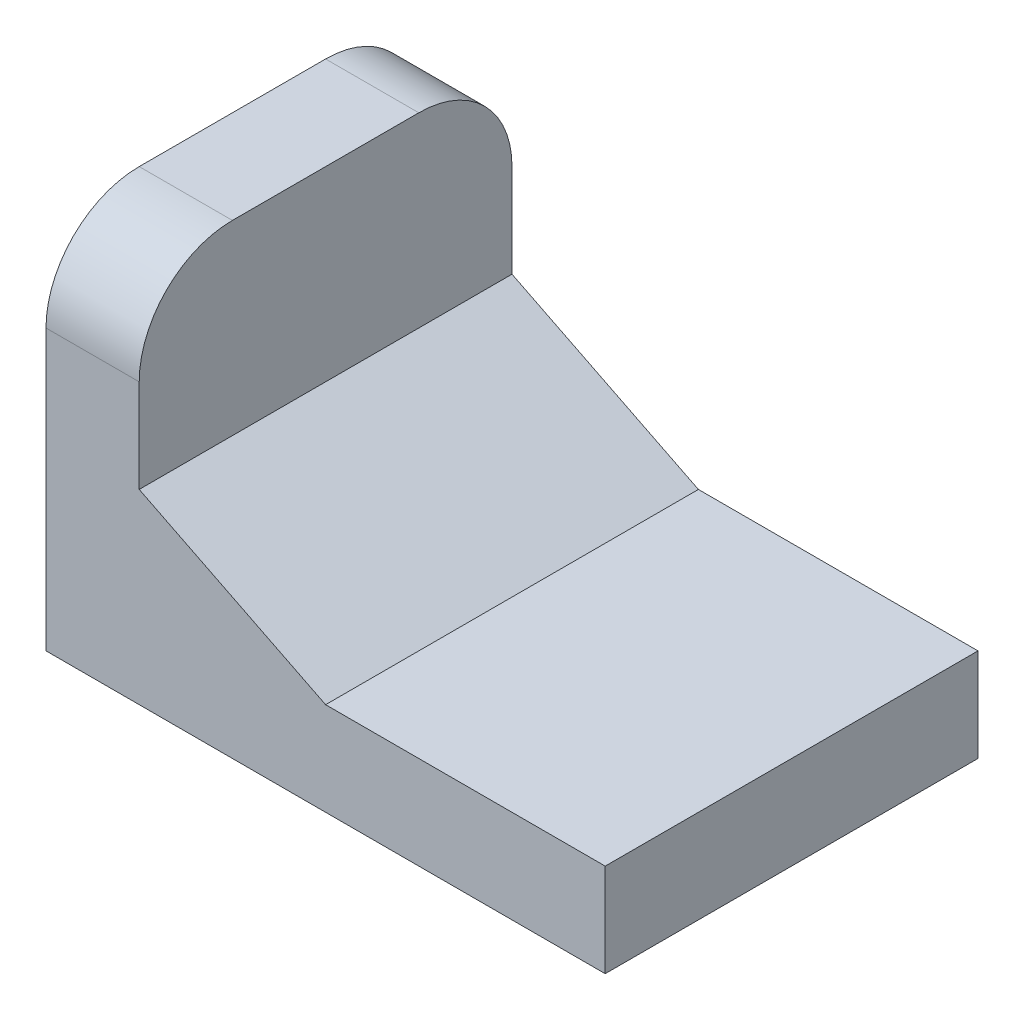
ISO-10303-21;
HEADER;
FILE_DESCRIPTION(('STEP AP214'),'2;1');
FILE_NAME('part.step','',(''),(''),'','','');
FILE_SCHEMA(('AUTOMOTIVE_DESIGN { 1 0 10303 214 1 1 1 1 }'));
ENDSEC;
DATA;
#1=APPLICATION_CONTEXT('core data for automotive mechanical design processes');
#2=APPLICATION_PROTOCOL_DEFINITION('international standard','automotive_design',2000,#1);
#3=PRODUCT_CONTEXT('',#1,'mechanical');
#4=PRODUCT('Part','Part','',(#3));
#5=PRODUCT_RELATED_PRODUCT_CATEGORY('part','',(#4));
#6=PRODUCT_DEFINITION_FORMATION('','',#4);
#7=PRODUCT_DEFINITION_CONTEXT('part definition',#1,'design');
#8=PRODUCT_DEFINITION('design','',#6,#7);
#9=PRODUCT_DEFINITION_SHAPE('','',#8);
#10=(LENGTH_UNIT() NAMED_UNIT(*) SI_UNIT(.MILLI.,.METRE.));
#11=(NAMED_UNIT(*) PLANE_ANGLE_UNIT() SI_UNIT($,.RADIAN.));
#12=(NAMED_UNIT(*) SI_UNIT($,.STERADIAN.) SOLID_ANGLE_UNIT());
#13=UNCERTAINTY_MEASURE_WITH_UNIT(LENGTH_MEASURE(1.E-05),#10,'distance_accuracy_value','');
#14=(GEOMETRIC_REPRESENTATION_CONTEXT(3) GLOBAL_UNCERTAINTY_ASSIGNED_CONTEXT((#13)) GLOBAL_UNIT_ASSIGNED_CONTEXT((#10,
#11,#12)) REPRESENTATION_CONTEXT('',''));
#15=CARTESIAN_POINT('',(0.,0.,0.));
#16=DIRECTION('',(0.,0.,1.));
#17=DIRECTION('',(1.,0.,0.));
#18=AXIS2_PLACEMENT_3D('',#15,#16,#17);
#19=CARTESIAN_POINT('',(0.,0.,20.));
#20=DIRECTION('',(0.,1.,0.));
#21=DIRECTION('',(0.,0.,1.));
#22=AXIS2_PLACEMENT_3D('',#19,#20,#21);
#23=PLANE('',#22);
#24=DIRECTION('',(1.,0.,0.));
#25=VECTOR('',#24,1.);
#26=CARTESIAN_POINT('',(0.,0.,0.));
#27=LINE('',#26,#25);
#28=CARTESIAN_POINT('',(0.,0.,0.));
#29=VERTEX_POINT('',#28);
#30=CARTESIAN_POINT('',(30.,0.,0.));
#31=VERTEX_POINT('',#30);
#32=EDGE_CURVE('E132',#29,#31,#27,.T.);
#33=ORIENTED_EDGE('',*,*,#32,.T.);
#34=DIRECTION('',(0.,0.,-1.));
#35=VECTOR('',#34,1.);
#36=CARTESIAN_POINT('',(30.,0.,20.));
#37=LINE('',#36,#35);
#38=CARTESIAN_POINT('',(30.,0.,20.));
#39=VERTEX_POINT('',#38);
#40=EDGE_CURVE('E117',#39,#31,#37,.T.);
#41=ORIENTED_EDGE('',*,*,#40,.F.);
#42=DIRECTION('',(1.,0.,0.));
#43=VECTOR('',#42,1.);
#44=CARTESIAN_POINT('',(0.,0.,20.));
#45=LINE('',#44,#43);
#46=CARTESIAN_POINT('',(0.,0.,20.));
#47=VERTEX_POINT('',#46);
#48=EDGE_CURVE('E123',#47,#39,#45,.T.);
#49=ORIENTED_EDGE('',*,*,#48,.F.);
#50=DIRECTION('',(0.,0.,-1.));
#51=VECTOR('',#50,1.);
#52=CARTESIAN_POINT('',(0.,0.,20.));
#53=LINE('',#52,#51);
#54=EDGE_CURVE('E175',#47,#29,#53,.T.);
#55=ORIENTED_EDGE('',*,*,#54,.T.);
#56=EDGE_LOOP('',(#33,#41,#49,#55));
#57=FACE_BOUND('',#56,.T.);
#58=ADVANCED_FACE('F39',(#57),#23,.F.);
#59=CARTESIAN_POINT('',(30.,0.,20.));
#60=DIRECTION('',(-1.,0.,0.));
#61=DIRECTION('',(0.,0.,1.));
#62=AXIS2_PLACEMENT_3D('',#59,#60,#61);
#63=PLANE('',#62);
#64=DIRECTION('',(0.,1.,0.));
#65=VECTOR('',#64,1.);
#66=CARTESIAN_POINT('',(30.,0.,0.));
#67=LINE('',#66,#65);
#68=CARTESIAN_POINT('',(30.,5.,0.));
#69=VERTEX_POINT('',#68);
#70=EDGE_CURVE('E191',#31,#69,#67,.T.);
#71=ORIENTED_EDGE('',*,*,#70,.T.);
#72=DIRECTION('',(0.,0.,-1.));
#73=VECTOR('',#72,1.);
#74=CARTESIAN_POINT('',(30.,5.,20.));
#75=LINE('',#74,#73);
#76=CARTESIAN_POINT('',(30.,5.,20.));
#77=VERTEX_POINT('',#76);
#78=EDGE_CURVE('E119',#77,#69,#75,.T.);
#79=ORIENTED_EDGE('',*,*,#78,.F.);
#80=DIRECTION('',(0.,1.,0.));
#81=VECTOR('',#80,1.);
#82=CARTESIAN_POINT('',(30.,0.,20.));
#83=LINE('',#82,#81);
#84=EDGE_CURVE('E112',#39,#77,#83,.T.);
#85=ORIENTED_EDGE('',*,*,#84,.F.);
#86=ORIENTED_EDGE('',*,*,#40,.T.);
#87=EDGE_LOOP('',(#71,#79,#85,#86));
#88=FACE_BOUND('',#87,.T.);
#89=ADVANCED_FACE('F115',(#88),#63,.F.);
#90=CARTESIAN_POINT('',(0.,5.,20.));
#91=DIRECTION('',(0.,1.,0.));
#92=DIRECTION('',(0.,0.,1.));
#93=AXIS2_PLACEMENT_3D('',#90,#91,#92);
#94=PLANE('',#93);
#95=DIRECTION('',(1.,0.,0.));
#96=VECTOR('',#95,1.);
#97=CARTESIAN_POINT('',(0.,5.,0.));
#98=LINE('',#97,#96);
#99=CARTESIAN_POINT('',(15.,5.,0.));
#100=VERTEX_POINT('',#99);
#101=EDGE_CURVE('E188',#100,#69,#98,.T.);
#102=ORIENTED_EDGE('',*,*,#101,.F.);
#103=DIRECTION('',(0.,0.,-1.));
#104=VECTOR('',#103,1.);
#105=CARTESIAN_POINT('',(15.,5.,20.));
#106=LINE('',#105,#104);
#107=CARTESIAN_POINT('',(15.,5.,20.));
#108=VERTEX_POINT('',#107);
#109=EDGE_CURVE('E138',#108,#100,#106,.T.);
#110=ORIENTED_EDGE('',*,*,#109,.F.);
#111=DIRECTION('',(1.,0.,0.));
#112=VECTOR('',#111,1.);
#113=CARTESIAN_POINT('',(0.,5.,20.));
#114=LINE('',#113,#112);
#115=EDGE_CURVE('E122',#108,#77,#114,.T.);
#116=ORIENTED_EDGE('',*,*,#115,.T.);
#117=ORIENTED_EDGE('',*,*,#78,.T.);
#118=EDGE_LOOP('',(#102,#110,#116,#117));
#119=FACE_BOUND('',#118,.T.);
#120=ADVANCED_FACE('F190',(#119),#94,.T.);
#121=CARTESIAN_POINT('',(4.99999999999999,10.,20.));
#122=DIRECTION('',(-0.447213595499958,-0.894427190999916,0.));
#123=DIRECTION('',(0.894427190999916,-0.447213595499958,0.));
#124=AXIS2_PLACEMENT_3D('',#121,#122,#123);
#125=PLANE('',#124);
#126=DIRECTION('',(-0.894427190999916,0.447213595499958,0.));
#127=VECTOR('',#126,1.);
#128=CARTESIAN_POINT('',(4.99999999999999,10.,0.));
#129=LINE('',#128,#127);
#130=CARTESIAN_POINT('',(5.,9.99999999999999,0.));
#131=VERTEX_POINT('',#130);
#132=EDGE_CURVE('E183',#100,#131,#129,.T.);
#133=ORIENTED_EDGE('',*,*,#132,.T.);
#134=DIRECTION('',(0.,0.,-1.));
#135=VECTOR('',#134,1.);
#136=CARTESIAN_POINT('',(5.,9.99999999999999,20.));
#137=LINE('',#136,#135);
#138=CARTESIAN_POINT('',(5.,9.99999999999999,20.));
#139=VERTEX_POINT('',#138);
#140=EDGE_CURVE('E172',#139,#131,#137,.T.);
#141=ORIENTED_EDGE('',*,*,#140,.F.);
#142=DIRECTION('',(-0.894427190999916,0.447213595499958,0.));
#143=VECTOR('',#142,1.);
#144=CARTESIAN_POINT('',(4.99999999999999,10.,20.));
#145=LINE('',#144,#143);
#146=EDGE_CURVE('E184',#108,#139,#145,.T.);
#147=ORIENTED_EDGE('',*,*,#146,.F.);
#148=ORIENTED_EDGE('',*,*,#109,.T.);
#149=EDGE_LOOP('',(#133,#141,#147,#148));
#150=FACE_BOUND('',#149,.T.);
#151=ADVANCED_FACE('F181',(#150),#125,.F.);
#152=CARTESIAN_POINT('',(5.00000000000001,0.,20.));
#153=DIRECTION('',(-1.,0.,0.));
#154=DIRECTION('',(0.,-1.,0.));
#155=AXIS2_PLACEMENT_3D('',#152,#153,#154);
#156=PLANE('',#155);
#157=DIRECTION('',(0.,1.,0.));
#158=VECTOR('',#157,1.);
#159=CARTESIAN_POINT('',(5.00000000000001,0.,0.));
#160=LINE('',#159,#158);
#161=CARTESIAN_POINT('',(5.,15.,0.));
#162=VERTEX_POINT('',#161);
#163=EDGE_CURVE('E162',#131,#162,#160,.T.);
#164=ORIENTED_EDGE('',*,*,#163,.T.);
#165=CARTESIAN_POINT('',(5.,15.,5.));
#166=DIRECTION('',(-1.,0.,0.));
#167=DIRECTION('',(0.,-1.,0.));
#168=AXIS2_PLACEMENT_3D('',#165,#166,#167);
#169=CIRCLE('',#168,5.);
#170=CARTESIAN_POINT('',(4.99999999999999,20.,5.));
#171=VERTEX_POINT('',#170);
#172=EDGE_CURVE('E143',#162,#171,#169,.F.);
#173=ORIENTED_EDGE('',*,*,#172,.T.);
#174=DIRECTION('',(0.,0.,-1.));
#175=VECTOR('',#174,1.);
#176=CARTESIAN_POINT('',(4.99999999999999,20.,20.));
#177=LINE('',#176,#175);
#178=CARTESIAN_POINT('',(4.99999999999999,20.,15.));
#179=VERTEX_POINT('',#178);
#180=EDGE_CURVE('E168',#179,#171,#177,.T.);
#181=ORIENTED_EDGE('',*,*,#180,.F.);
#182=CARTESIAN_POINT('',(5.,15.,15.));
#183=DIRECTION('',(-1.,0.,0.));
#184=DIRECTION('',(0.,-1.,0.));
#185=AXIS2_PLACEMENT_3D('',#182,#183,#184);
#186=CIRCLE('',#185,5.);
#187=CARTESIAN_POINT('',(5.,15.,20.));
#188=VERTEX_POINT('',#187);
#189=EDGE_CURVE('E136',#179,#188,#186,.F.);
#190=ORIENTED_EDGE('',*,*,#189,.T.);
#191=DIRECTION('',(0.,1.,0.));
#192=VECTOR('',#191,1.);
#193=CARTESIAN_POINT('',(5.00000000000001,0.,20.));
#194=LINE('',#193,#192);
#195=EDGE_CURVE('E196',#139,#188,#194,.T.);
#196=ORIENTED_EDGE('',*,*,#195,.F.);
#197=ORIENTED_EDGE('',*,*,#140,.T.);
#198=EDGE_LOOP('',(#164,#173,#181,#190,#196,#197));
#199=FACE_BOUND('',#198,.T.);
#200=ADVANCED_FACE('F167',(#199),#156,.F.);
#201=CARTESIAN_POINT('',(0.,20.,20.));
#202=DIRECTION('',(0.,1.,0.));
#203=DIRECTION('',(0.,0.,1.));
#204=AXIS2_PLACEMENT_3D('',#201,#202,#203);
#205=PLANE('',#204);
#206=ORIENTED_EDGE('',*,*,#180,.T.);
#207=DIRECTION('',(1.,0.,0.));
#208=VECTOR('',#207,1.);
#209=CARTESIAN_POINT('',(0.,20.,5.));
#210=LINE('',#209,#208);
#211=CARTESIAN_POINT('',(0.,20.,5.));
#212=VERTEX_POINT('',#211);
#213=EDGE_CURVE('E60',#171,#212,#210,.F.);
#214=ORIENTED_EDGE('',*,*,#213,.T.);
#215=DIRECTION('',(0.,0.,-1.));
#216=VECTOR('',#215,1.);
#217=CARTESIAN_POINT('',(0.,20.,20.));
#218=LINE('',#217,#216);
#219=CARTESIAN_POINT('',(0.,20.,15.));
#220=VERTEX_POINT('',#219);
#221=EDGE_CURVE('E155',#220,#212,#218,.T.);
#222=ORIENTED_EDGE('',*,*,#221,.F.);
#223=DIRECTION('',(1.,0.,0.));
#224=VECTOR('',#223,1.);
#225=CARTESIAN_POINT('',(0.,20.,15.));
#226=LINE('',#225,#224);
#227=EDGE_CURVE('E145',#220,#179,#226,.T.);
#228=ORIENTED_EDGE('',*,*,#227,.T.);
#229=EDGE_LOOP('',(#206,#214,#222,#228));
#230=FACE_BOUND('',#229,.T.);
#231=ADVANCED_FACE('F170',(#230),#205,.T.);
#232=CARTESIAN_POINT('',(0.,0.,20.));
#233=DIRECTION('',(-1.,0.,0.));
#234=DIRECTION('',(0.,0.,1.));
#235=AXIS2_PLACEMENT_3D('',#232,#233,#234);
#236=PLANE('',#235);
#237=ORIENTED_EDGE('',*,*,#221,.T.);
#238=CARTESIAN_POINT('',(0.,15.,5.));
#239=DIRECTION('',(-1.,0.,0.));
#240=DIRECTION('',(0.,0.,1.));
#241=AXIS2_PLACEMENT_3D('',#238,#239,#240);
#242=CIRCLE('',#241,5.);
#243=CARTESIAN_POINT('',(0.,15.,0.));
#244=VERTEX_POINT('',#243);
#245=EDGE_CURVE('E47',#212,#244,#242,.T.);
#246=ORIENTED_EDGE('',*,*,#245,.T.);
#247=DIRECTION('',(0.,1.,0.));
#248=VECTOR('',#247,1.);
#249=CARTESIAN_POINT('',(0.,0.,0.));
#250=LINE('',#249,#248);
#251=EDGE_CURVE('E129',#29,#244,#250,.T.);
#252=ORIENTED_EDGE('',*,*,#251,.F.);
#253=ORIENTED_EDGE('',*,*,#54,.F.);
#254=DIRECTION('',(0.,1.,0.));
#255=VECTOR('',#254,1.);
#256=CARTESIAN_POINT('',(0.,0.,20.));
#257=LINE('',#256,#255);
#258=CARTESIAN_POINT('',(0.,15.,20.));
#259=VERTEX_POINT('',#258);
#260=EDGE_CURVE('E127',#47,#259,#257,.T.);
#261=ORIENTED_EDGE('',*,*,#260,.T.);
#262=CARTESIAN_POINT('',(0.,15.,15.));
#263=DIRECTION('',(-1.,0.,0.));
#264=DIRECTION('',(0.,0.,1.));
#265=AXIS2_PLACEMENT_3D('',#262,#263,#264);
#266=CIRCLE('',#265,5.);
#267=EDGE_CURVE('E149',#259,#220,#266,.T.);
#268=ORIENTED_EDGE('',*,*,#267,.T.);
#269=EDGE_LOOP('',(#237,#246,#252,#253,#261,#268));
#270=FACE_BOUND('',#269,.T.);
#271=ADVANCED_FACE('F154',(#270),#236,.T.);
#272=CARTESIAN_POINT('',(0.,0.,20.));
#273=DIRECTION('',(0.,0.,1.));
#274=DIRECTION('',(1.,0.,0.));
#275=AXIS2_PLACEMENT_3D('',#272,#273,#274);
#276=PLANE('',#275);
#277=ORIENTED_EDGE('',*,*,#195,.T.);
#278=DIRECTION('',(1.,0.,0.));
#279=VECTOR('',#278,1.);
#280=CARTESIAN_POINT('',(0.,15.,20.));
#281=LINE('',#280,#279);
#282=EDGE_CURVE('E11',#188,#259,#281,.F.);
#283=ORIENTED_EDGE('',*,*,#282,.T.);
#284=ORIENTED_EDGE('',*,*,#260,.F.);
#285=ORIENTED_EDGE('',*,*,#48,.T.);
#286=ORIENTED_EDGE('',*,*,#84,.T.);
#287=ORIENTED_EDGE('',*,*,#115,.F.);
#288=ORIENTED_EDGE('',*,*,#146,.T.);
#289=EDGE_LOOP('',(#277,#283,#284,#285,#286,#287,#288));
#290=FACE_BOUND('',#289,.T.);
#291=ADVANCED_FACE('F126',(#290),#276,.T.);
#292=CARTESIAN_POINT('',(0.,0.,0.));
#293=DIRECTION('',(0.,0.,1.));
#294=DIRECTION('',(1.,0.,0.));
#295=AXIS2_PLACEMENT_3D('',#292,#293,#294);
#296=PLANE('',#295);
#297=ORIENTED_EDGE('',*,*,#251,.T.);
#298=DIRECTION('',(1.,0.,0.));
#299=VECTOR('',#298,1.);
#300=CARTESIAN_POINT('',(4.99999999999999,15.,0.));
#301=LINE('',#300,#299);
#302=EDGE_CURVE('E133',#244,#162,#301,.T.);
#303=ORIENTED_EDGE('',*,*,#302,.T.);
#304=ORIENTED_EDGE('',*,*,#163,.F.);
#305=ORIENTED_EDGE('',*,*,#132,.F.);
#306=ORIENTED_EDGE('',*,*,#101,.T.);
#307=ORIENTED_EDGE('',*,*,#70,.F.);
#308=ORIENTED_EDGE('',*,*,#32,.F.);
#309=EDGE_LOOP('',(#297,#303,#304,#305,#306,#307,#308));
#310=FACE_BOUND('',#309,.T.);
#311=ADVANCED_FACE('F159',(#310),#296,.F.);
#312=CARTESIAN_POINT('',(0.,15.,5.));
#313=DIRECTION('',(-1.,0.,0.));
#314=DIRECTION('',(0.,0.,1.));
#315=AXIS2_PLACEMENT_3D('',#312,#313,#314);
#316=CYLINDRICAL_SURFACE('',#315,5.);
#317=ORIENTED_EDGE('',*,*,#245,.F.);
#318=ORIENTED_EDGE('',*,*,#213,.F.);
#319=ORIENTED_EDGE('',*,*,#172,.F.);
#320=ORIENTED_EDGE('',*,*,#302,.F.);
#321=EDGE_LOOP('',(#317,#318,#319,#320));
#322=FACE_BOUND('',#321,.T.);
#323=ADVANCED_FACE('F164',(#322),#316,.T.);
#324=CARTESIAN_POINT('',(0.,15.,15.));
#325=DIRECTION('',(1.,0.,0.));
#326=DIRECTION('',(0.,0.,-1.));
#327=AXIS2_PLACEMENT_3D('',#324,#325,#326);
#328=CYLINDRICAL_SURFACE('',#327,5.);
#329=ORIENTED_EDGE('',*,*,#267,.F.);
#330=ORIENTED_EDGE('',*,*,#282,.F.);
#331=ORIENTED_EDGE('',*,*,#189,.F.);
#332=ORIENTED_EDGE('',*,*,#227,.F.);
#333=EDGE_LOOP('',(#329,#330,#331,#332));
#334=FACE_BOUND('',#333,.T.);
#335=ADVANCED_FACE('F41',(#334),#328,.T.);
#336=CLOSED_SHELL('',(#58,#89,#120,#151,#200,#231,#271,#291,#311,#323,#335));
#337=MANIFOLD_SOLID_BREP('B2',#336);
#338=ADVANCED_BREP_SHAPE_REPRESENTATION('',(#18,#337),#14);
#339=SHAPE_DEFINITION_REPRESENTATION(#9,#338);
ENDSEC;
END-ISO-10303-21;
